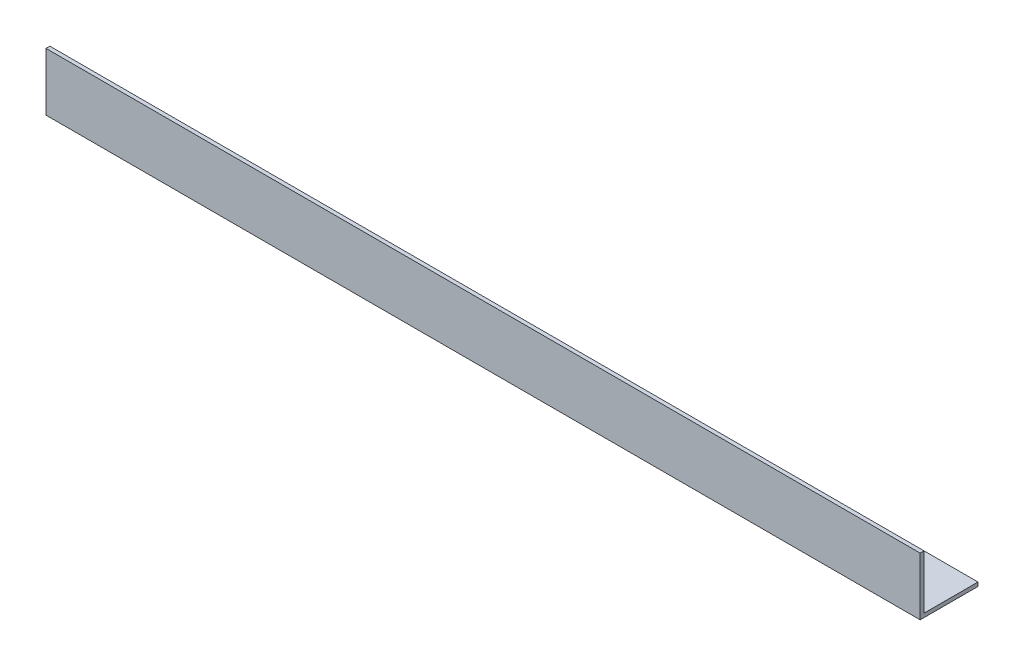
ISO-10303-21;
HEADER;
FILE_DESCRIPTION(('STEP AP214'),'2;1');
FILE_NAME('part.step','',(''),(''),'','','');
FILE_SCHEMA(('AUTOMOTIVE_DESIGN { 1 0 10303 214 1 1 1 1 }'));
ENDSEC;
DATA;
#1=APPLICATION_CONTEXT('core data for automotive mechanical design processes');
#2=APPLICATION_PROTOCOL_DEFINITION('international standard','automotive_design',2000,#1);
#3=PRODUCT_CONTEXT('',#1,'mechanical');
#4=PRODUCT('Part','Part','',(#3));
#5=PRODUCT_RELATED_PRODUCT_CATEGORY('part','',(#4));
#6=PRODUCT_DEFINITION_FORMATION('','',#4);
#7=PRODUCT_DEFINITION_CONTEXT('part definition',#1,'design');
#8=PRODUCT_DEFINITION('design','',#6,#7);
#9=PRODUCT_DEFINITION_SHAPE('','',#8);
#10=(LENGTH_UNIT() NAMED_UNIT(*) SI_UNIT(.MILLI.,.METRE.));
#11=(NAMED_UNIT(*) PLANE_ANGLE_UNIT() SI_UNIT($,.RADIAN.));
#12=(NAMED_UNIT(*) SI_UNIT($,.STERADIAN.) SOLID_ANGLE_UNIT());
#13=UNCERTAINTY_MEASURE_WITH_UNIT(LENGTH_MEASURE(1.E-05),#10,'distance_accuracy_value','');
#14=(GEOMETRIC_REPRESENTATION_CONTEXT(3) GLOBAL_UNCERTAINTY_ASSIGNED_CONTEXT((#13)) GLOBAL_UNIT_ASSIGNED_CONTEXT((#10,
#11,#12)) REPRESENTATION_CONTEXT('',''));
#15=CARTESIAN_POINT('',(0.,0.,0.));
#16=DIRECTION('',(0.,0.,1.));
#17=DIRECTION('',(1.,0.,0.));
#18=AXIS2_PLACEMENT_3D('',#15,#16,#17);
#19=CARTESIAN_POINT('',(680.,0.,0.));
#20=DIRECTION('',(0.,1.,0.));
#21=DIRECTION('',(0.,0.,1.));
#22=AXIS2_PLACEMENT_3D('',#19,#20,#21);
#23=PLANE('',#22);
#24=DIRECTION('',(0.,0.,-1.));
#25=VECTOR('',#24,1.);
#26=CARTESIAN_POINT('',(0.,0.,0.));
#27=LINE('',#26,#25);
#28=CARTESIAN_POINT('',(0.,0.,0.));
#29=VERTEX_POINT('',#28);
#30=CARTESIAN_POINT('',(0.,0.,-45.));
#31=VERTEX_POINT('',#30);
#32=EDGE_CURVE('E116',#29,#31,#27,.T.);
#33=ORIENTED_EDGE('',*,*,#32,.T.);
#34=DIRECTION('',(-1.,0.,0.));
#35=VECTOR('',#34,1.);
#36=CARTESIAN_POINT('',(680.,0.,-45.));
#37=LINE('',#36,#35);
#38=CARTESIAN_POINT('',(680.,0.,-45.));
#39=VERTEX_POINT('',#38);
#40=EDGE_CURVE('E11',#39,#31,#37,.T.);
#41=ORIENTED_EDGE('',*,*,#40,.F.);
#42=DIRECTION('',(0.,0.,-1.));
#43=VECTOR('',#42,1.);
#44=CARTESIAN_POINT('',(680.,0.,0.));
#45=LINE('',#44,#43);
#46=CARTESIAN_POINT('',(680.,0.,0.));
#47=VERTEX_POINT('',#46);
#48=EDGE_CURVE('E81',#47,#39,#45,.T.);
#49=ORIENTED_EDGE('',*,*,#48,.F.);
#50=DIRECTION('',(-1.,0.,0.));
#51=VECTOR('',#50,1.);
#52=CARTESIAN_POINT('',(680.,0.,0.));
#53=LINE('',#52,#51);
#54=EDGE_CURVE('E112',#47,#29,#53,.T.);
#55=ORIENTED_EDGE('',*,*,#54,.T.);
#56=EDGE_LOOP('',(#33,#41,#49,#55));
#57=FACE_BOUND('',#56,.T.);
#58=ADVANCED_FACE('F35',(#57),#23,.F.);
#59=CARTESIAN_POINT('',(680.,3.,-45.));
#60=DIRECTION('',(0.,0.,-1.));
#61=DIRECTION('',(-1.,0.,0.));
#62=AXIS2_PLACEMENT_3D('',#59,#60,#61);
#63=PLANE('',#62);
#64=DIRECTION('',(0.,-1.,0.));
#65=VECTOR('',#64,1.);
#66=CARTESIAN_POINT('',(0.,3.,-45.));
#67=LINE('',#66,#65);
#68=CARTESIAN_POINT('',(0.,3.,-45.));
#69=VERTEX_POINT('',#68);
#70=EDGE_CURVE('E119',#69,#31,#67,.T.);
#71=ORIENTED_EDGE('',*,*,#70,.F.);
#72=DIRECTION('',(-1.,0.,0.));
#73=VECTOR('',#72,1.);
#74=CARTESIAN_POINT('',(680.,3.,-45.));
#75=LINE('',#74,#73);
#76=CARTESIAN_POINT('',(680.,3.,-45.));
#77=VERTEX_POINT('',#76);
#78=EDGE_CURVE('E43',#77,#69,#75,.T.);
#79=ORIENTED_EDGE('',*,*,#78,.F.);
#80=DIRECTION('',(0.,-1.,0.));
#81=VECTOR('',#80,1.);
#82=CARTESIAN_POINT('',(680.,3.,-45.));
#83=LINE('',#82,#81);
#84=EDGE_CURVE('E205',#77,#39,#83,.T.);
#85=ORIENTED_EDGE('',*,*,#84,.T.);
#86=ORIENTED_EDGE('',*,*,#40,.T.);
#87=EDGE_LOOP('',(#71,#79,#85,#86));
#88=FACE_BOUND('',#87,.T.);
#89=ADVANCED_FACE('F137',(#88),#63,.T.);
#90=CARTESIAN_POINT('',(680.,3.,0.));
#91=DIRECTION('',(0.,1.,0.));
#92=DIRECTION('',(0.,0.,1.));
#93=AXIS2_PLACEMENT_3D('',#90,#91,#92);
#94=PLANE('',#93);
#95=DIRECTION('',(0.,0.,-1.));
#96=VECTOR('',#95,1.);
#97=CARTESIAN_POINT('',(0.,3.,0.));
#98=LINE('',#97,#96);
#99=CARTESIAN_POINT('',(0.,3.,-3.));
#100=VERTEX_POINT('',#99);
#101=EDGE_CURVE('E122',#100,#69,#98,.T.);
#102=ORIENTED_EDGE('',*,*,#101,.F.);
#103=DIRECTION('',(-1.,0.,0.));
#104=VECTOR('',#103,1.);
#105=CARTESIAN_POINT('',(680.,3.,-3.));
#106=LINE('',#105,#104);
#107=CARTESIAN_POINT('',(680.,3.,-3.));
#108=VERTEX_POINT('',#107);
#109=EDGE_CURVE('E102',#108,#100,#106,.T.);
#110=ORIENTED_EDGE('',*,*,#109,.F.);
#111=DIRECTION('',(0.,0.,-1.));
#112=VECTOR('',#111,1.);
#113=CARTESIAN_POINT('',(680.,3.,0.));
#114=LINE('',#113,#112);
#115=EDGE_CURVE('E108',#108,#77,#114,.T.);
#116=ORIENTED_EDGE('',*,*,#115,.T.);
#117=ORIENTED_EDGE('',*,*,#78,.T.);
#118=EDGE_LOOP('',(#102,#110,#116,#117));
#119=FACE_BOUND('',#118,.T.);
#120=ADVANCED_FACE('F134',(#119),#94,.T.);
#121=CARTESIAN_POINT('',(680.,0.,-3.));
#122=DIRECTION('',(0.,0.,-1.));
#123=DIRECTION('',(-1.,0.,0.));
#124=AXIS2_PLACEMENT_3D('',#121,#122,#123);
#125=PLANE('',#124);
#126=DIRECTION('',(0.,1.,0.));
#127=VECTOR('',#126,1.);
#128=CARTESIAN_POINT('',(0.,0.,-3.));
#129=LINE('',#128,#127);
#130=CARTESIAN_POINT('',(0.,45.,-3.));
#131=VERTEX_POINT('',#130);
#132=EDGE_CURVE('E97',#131,#100,#129,.F.);
#133=ORIENTED_EDGE('',*,*,#132,.F.);
#134=DIRECTION('',(-1.,0.,0.));
#135=VECTOR('',#134,1.);
#136=CARTESIAN_POINT('',(680.,45.,-3.));
#137=LINE('',#136,#135);
#138=CARTESIAN_POINT('',(680.,45.,-3.));
#139=VERTEX_POINT('',#138);
#140=EDGE_CURVE('E92',#139,#131,#137,.T.);
#141=ORIENTED_EDGE('',*,*,#140,.F.);
#142=DIRECTION('',(0.,1.,0.));
#143=VECTOR('',#142,1.);
#144=CARTESIAN_POINT('',(680.,0.,-3.));
#145=LINE('',#144,#143);
#146=EDGE_CURVE('E95',#139,#108,#145,.F.);
#147=ORIENTED_EDGE('',*,*,#146,.T.);
#148=ORIENTED_EDGE('',*,*,#109,.T.);
#149=EDGE_LOOP('',(#133,#141,#147,#148));
#150=FACE_BOUND('',#149,.T.);
#151=ADVANCED_FACE('F94',(#150),#125,.T.);
#152=CARTESIAN_POINT('',(680.,45.,0.));
#153=DIRECTION('',(0.,1.,0.));
#154=DIRECTION('',(0.,0.,1.));
#155=AXIS2_PLACEMENT_3D('',#152,#153,#154);
#156=PLANE('',#155);
#157=DIRECTION('',(0.,0.,-1.));
#158=VECTOR('',#157,1.);
#159=CARTESIAN_POINT('',(0.,45.,0.));
#160=LINE('',#159,#158);
#161=CARTESIAN_POINT('',(0.,45.,0.));
#162=VERTEX_POINT('',#161);
#163=EDGE_CURVE('E126',#162,#131,#160,.T.);
#164=ORIENTED_EDGE('',*,*,#163,.F.);
#165=DIRECTION('',(-1.,0.,0.));
#166=VECTOR('',#165,1.);
#167=CARTESIAN_POINT('',(680.,45.,0.));
#168=LINE('',#167,#166);
#169=CARTESIAN_POINT('',(680.,45.,0.));
#170=VERTEX_POINT('',#169);
#171=EDGE_CURVE('E72',#170,#162,#168,.T.);
#172=ORIENTED_EDGE('',*,*,#171,.F.);
#173=DIRECTION('',(0.,0.,-1.));
#174=VECTOR('',#173,1.);
#175=CARTESIAN_POINT('',(680.,45.,0.));
#176=LINE('',#175,#174);
#177=EDGE_CURVE('E106',#170,#139,#176,.T.);
#178=ORIENTED_EDGE('',*,*,#177,.T.);
#179=ORIENTED_EDGE('',*,*,#140,.T.);
#180=EDGE_LOOP('',(#164,#172,#178,#179));
#181=FACE_BOUND('',#180,.T.);
#182=ADVANCED_FACE('F110',(#181),#156,.T.);
#183=CARTESIAN_POINT('',(680.,0.,0.));
#184=DIRECTION('',(0.,0.,-1.));
#185=DIRECTION('',(-1.,0.,0.));
#186=AXIS2_PLACEMENT_3D('',#183,#184,#185);
#187=PLANE('',#186);
#188=DIRECTION('',(0.,-1.,0.));
#189=VECTOR('',#188,1.);
#190=CARTESIAN_POINT('',(0.,0.,0.));
#191=LINE('',#190,#189);
#192=EDGE_CURVE('E75',#162,#29,#191,.T.);
#193=ORIENTED_EDGE('',*,*,#192,.T.);
#194=ORIENTED_EDGE('',*,*,#54,.F.);
#195=DIRECTION('',(0.,-1.,0.));
#196=VECTOR('',#195,1.);
#197=CARTESIAN_POINT('',(680.,0.,0.));
#198=LINE('',#197,#196);
#199=EDGE_CURVE('E51',#170,#47,#198,.T.);
#200=ORIENTED_EDGE('',*,*,#199,.F.);
#201=ORIENTED_EDGE('',*,*,#171,.T.);
#202=EDGE_LOOP('',(#193,#194,#200,#201));
#203=FACE_BOUND('',#202,.T.);
#204=ADVANCED_FACE('F142',(#203),#187,.F.);
#205=CARTESIAN_POINT('',(680.,0.,0.));
#206=DIRECTION('',(-1.,0.,0.));
#207=DIRECTION('',(0.,0.,1.));
#208=AXIS2_PLACEMENT_3D('',#205,#206,#207);
#209=PLANE('',#208);
#210=ORIENTED_EDGE('',*,*,#48,.T.);
#211=ORIENTED_EDGE('',*,*,#84,.F.);
#212=ORIENTED_EDGE('',*,*,#115,.F.);
#213=ORIENTED_EDGE('',*,*,#146,.F.);
#214=ORIENTED_EDGE('',*,*,#177,.F.);
#215=ORIENTED_EDGE('',*,*,#199,.T.);
#216=EDGE_LOOP('',(#210,#211,#212,#213,#214,#215));
#217=FACE_BOUND('',#216,.T.);
#218=ADVANCED_FACE('F105',(#217),#209,.F.);
#219=CARTESIAN_POINT('',(0.,0.,0.));
#220=DIRECTION('',(-1.,0.,0.));
#221=DIRECTION('',(0.,0.,1.));
#222=AXIS2_PLACEMENT_3D('',#219,#220,#221);
#223=PLANE('',#222);
#224=ORIENTED_EDGE('',*,*,#32,.F.);
#225=ORIENTED_EDGE('',*,*,#192,.F.);
#226=ORIENTED_EDGE('',*,*,#163,.T.);
#227=ORIENTED_EDGE('',*,*,#132,.T.);
#228=ORIENTED_EDGE('',*,*,#101,.T.);
#229=ORIENTED_EDGE('',*,*,#70,.T.);
#230=EDGE_LOOP('',(#224,#225,#226,#227,#228,#229));
#231=FACE_BOUND('',#230,.T.);
#232=ADVANCED_FACE('F140',(#231),#223,.T.);
#233=CLOSED_SHELL('',(#58,#89,#120,#151,#182,#204,#218,#232));
#234=MANIFOLD_SOLID_BREP('B2',#233);
#235=ADVANCED_BREP_SHAPE_REPRESENTATION('',(#18,#234),#14);
#236=SHAPE_DEFINITION_REPRESENTATION(#9,#235);
ENDSEC;
END-ISO-10303-21;
